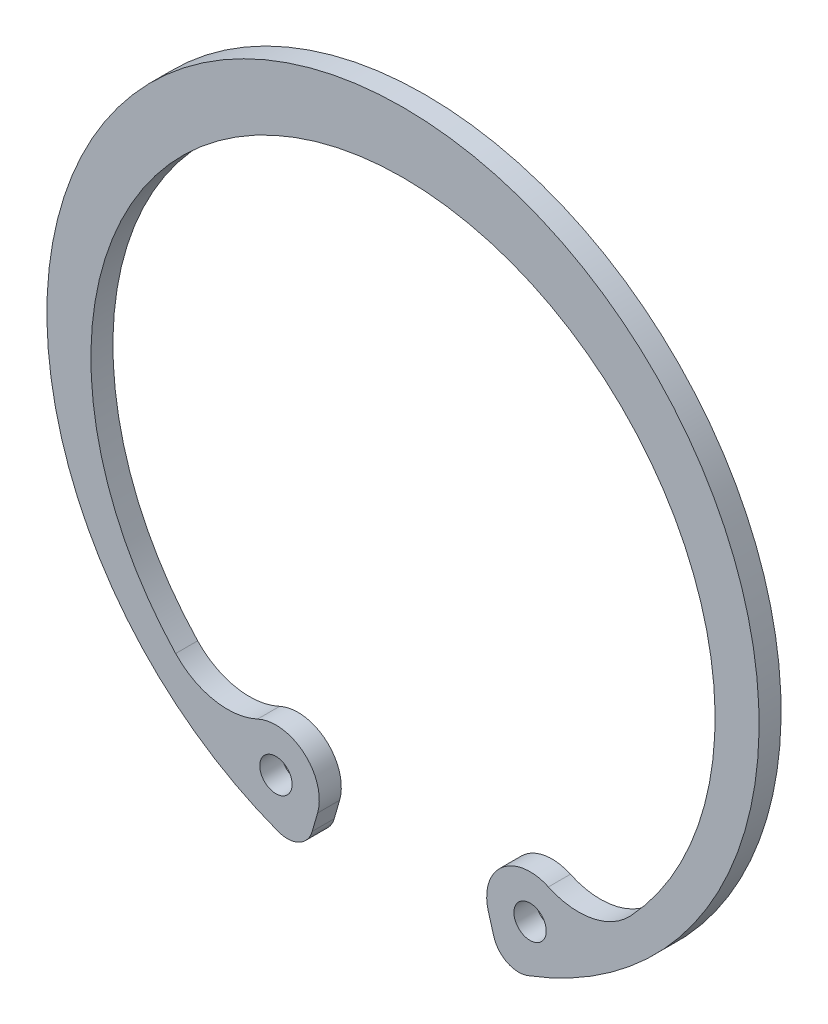
ISO-10303-21;
HEADER;
FILE_DESCRIPTION(('STEP AP214'),'2;1');
FILE_NAME('part.step','',(''),(''),'','','');
FILE_SCHEMA(('AUTOMOTIVE_DESIGN { 1 0 10303 214 1 1 1 1 }'));
ENDSEC;
DATA;
#1=APPLICATION_CONTEXT('core data for automotive mechanical design processes');
#2=APPLICATION_PROTOCOL_DEFINITION('international standard','automotive_design',2000,#1);
#3=PRODUCT_CONTEXT('',#1,'mechanical');
#4=PRODUCT('Part','Part','',(#3));
#5=PRODUCT_RELATED_PRODUCT_CATEGORY('part','',(#4));
#6=PRODUCT_DEFINITION_FORMATION('','',#4);
#7=PRODUCT_DEFINITION_CONTEXT('part definition',#1,'design');
#8=PRODUCT_DEFINITION('design','',#6,#7);
#9=PRODUCT_DEFINITION_SHAPE('','',#8);
#10=(LENGTH_UNIT() NAMED_UNIT(*) SI_UNIT(.MILLI.,.METRE.));
#11=(NAMED_UNIT(*) PLANE_ANGLE_UNIT() SI_UNIT($,.RADIAN.));
#12=(NAMED_UNIT(*) SI_UNIT($,.STERADIAN.) SOLID_ANGLE_UNIT());
#13=UNCERTAINTY_MEASURE_WITH_UNIT(LENGTH_MEASURE(1.E-05),#10,'distance_accuracy_value','');
#14=(GEOMETRIC_REPRESENTATION_CONTEXT(3) GLOBAL_UNCERTAINTY_ASSIGNED_CONTEXT((#13)) GLOBAL_UNIT_ASSIGNED_CONTEXT((#10,
#11,#12)) REPRESENTATION_CONTEXT('',''));
#15=CARTESIAN_POINT('',(0.,0.,0.));
#16=DIRECTION('',(0.,0.,1.));
#17=DIRECTION('',(1.,0.,0.));
#18=AXIS2_PLACEMENT_3D('',#15,#16,#17);
#19=CARTESIAN_POINT('',(-13.5506791910204,-14.045394064784,1.7));
#20=DIRECTION('',(0.,0.,1.));
#21=DIRECTION('',(1.,0.,0.));
#22=AXIS2_PLACEMENT_3D('',#19,#20,#21);
#23=PLANE('',#22);
#24=CARTESIAN_POINT('',(-9.8132507378966,-22.0674965671072,1.7));
#25=DIRECTION('',(0.,0.,1.));
#26=DIRECTION('',(1.,0.,0.));
#27=AXIS2_PLACEMENT_3D('',#24,#25,#26);
#28=CIRCLE('',#27,1.25);
#29=CARTESIAN_POINT('',(-8.5632507378966,-22.0674965671072,1.7));
#30=VERTEX_POINT('',#29);
#31=EDGE_CURVE('E150',#30,#30,#28,.T.);
#32=ORIENTED_EDGE('',*,*,#31,.F.);
#33=EDGE_LOOP('',(#32));
#34=FACE_BOUND('',#33,.T.);
#35=CARTESIAN_POINT('',(-13.5506791910204,-14.045394064784,1.7));
#36=DIRECTION('',(0.,0.,-1.));
#37=DIRECTION('',(1.,0.,0.));
#38=AXIS2_PLACEMENT_3D('',#35,#36,#37);
#39=CIRCLE('',#38,5.49999999999998);
#40=CARTESIAN_POINT('',(-11.2279835421864,-19.0308814956063,1.7));
#41=VERTEX_POINT('',#40);
#42=CARTESIAN_POINT('',(-17.5572363209895,-17.8133510661699,1.7));
#43=VERTEX_POINT('',#42);
#44=EDGE_CURVE('E165',#41,#43,#39,.T.);
#45=ORIENTED_EDGE('',*,*,#44,.T.);
#46=CARTESIAN_POINT('',(0.,-1.30169046215154,1.7));
#47=DIRECTION('',(0.,0.,-1.));
#48=DIRECTION('',(1.,0.,0.));
#49=AXIS2_PLACEMENT_3D('',#46,#47,#48);
#50=CIRCLE('',#49,24.1016904621515);
#51=CARTESIAN_POINT('',(17.5572363209895,-17.8133510661699,1.7));
#52=VERTEX_POINT('',#51);
#53=EDGE_CURVE('E103',#43,#52,#50,.T.);
#54=ORIENTED_EDGE('',*,*,#53,.T.);
#55=CARTESIAN_POINT('',(13.5506791910204,-14.045394064784,1.7));
#56=DIRECTION('',(0.,0.,-1.));
#57=DIRECTION('',(-1.,0.,0.));
#58=AXIS2_PLACEMENT_3D('',#55,#56,#57);
#59=CIRCLE('',#58,5.49999999999998);
#60=CARTESIAN_POINT('',(11.2279835421864,-19.0308814956063,1.7));
#61=VERTEX_POINT('',#60);
#62=EDGE_CURVE('E186',#52,#61,#59,.T.);
#63=ORIENTED_EDGE('',*,*,#62,.T.);
#64=CARTESIAN_POINT('',(9.8132507378966,-22.0674965671072,1.7));
#65=DIRECTION('',(0.,0.,1.));
#66=DIRECTION('',(-1.,0.,0.));
#67=AXIS2_PLACEMENT_3D('',#64,#65,#66);
#68=CIRCLE('',#67,3.35);
#69=CARTESIAN_POINT('',(6.59482328368072,-22.9971334435001,1.7));
#70=VERTEX_POINT('',#69);
#71=EDGE_CURVE('E205',#61,#70,#68,.T.);
#72=ORIENTED_EDGE('',*,*,#71,.T.);
#73=DIRECTION('',(0.277503545191909,-0.960724613198768,0.));
#74=VECTOR('',#73,1.);
#75=CARTESIAN_POINT('',(7.01136277037284,-24.4392041635608,1.7));
#76=LINE('',#75,#74);
#77=CARTESIAN_POINT('',(7.01136277037284,-24.4392041635608,1.7));
#78=VERTEX_POINT('',#77);
#79=EDGE_CURVE('E202',#70,#78,#76,.T.);
#80=ORIENTED_EDGE('',*,*,#79,.T.);
#81=CARTESIAN_POINT('',(8.93281199677038,-23.884197073177,1.7));
#82=DIRECTION('',(0.,0.,1.));
#83=DIRECTION('',(-1.,0.,0.));
#84=AXIS2_PLACEMENT_3D('',#81,#82,#83);
#85=CIRCLE('',#84,2.00000000000001);
#86=CARTESIAN_POINT('',(9.63342470239945,-25.7574674318575,1.7));
#87=VERTEX_POINT('',#86);
#88=EDGE_CURVE('E204',#78,#87,#85,.T.);
#89=ORIENTED_EDGE('',*,*,#88,.T.);
#90=CARTESIAN_POINT('',(0.,0.,1.7));
#91=DIRECTION('',(0.,0.,1.));
#92=DIRECTION('',(1.,0.,0.));
#93=AXIS2_PLACEMENT_3D('',#90,#91,#92);
#94=CIRCLE('',#93,27.5);
#95=CARTESIAN_POINT('',(-9.63342470239945,-25.7574674318575,1.7));
#96=VERTEX_POINT('',#95);
#97=EDGE_CURVE('E128',#87,#96,#94,.T.);
#98=ORIENTED_EDGE('',*,*,#97,.T.);
#99=CARTESIAN_POINT('',(-8.93281199677038,-23.884197073177,1.7));
#100=DIRECTION('',(0.,0.,1.));
#101=DIRECTION('',(1.,0.,0.));
#102=AXIS2_PLACEMENT_3D('',#99,#100,#101);
#103=CIRCLE('',#102,2.00000000000001);
#104=CARTESIAN_POINT('',(-7.01136277037284,-24.4392041635608,1.7));
#105=VERTEX_POINT('',#104);
#106=EDGE_CURVE('E122',#96,#105,#103,.T.);
#107=ORIENTED_EDGE('',*,*,#106,.T.);
#108=DIRECTION('',(0.277503545191909,0.960724613198768,0.));
#109=VECTOR('',#108,1.);
#110=CARTESIAN_POINT('',(-7.01136277037284,-24.4392041635608,1.7));
#111=LINE('',#110,#109);
#112=CARTESIAN_POINT('',(-6.59482328368072,-22.9971334435001,1.7));
#113=VERTEX_POINT('',#112);
#114=EDGE_CURVE('E126',#105,#113,#111,.T.);
#115=ORIENTED_EDGE('',*,*,#114,.T.);
#116=CARTESIAN_POINT('',(-9.8132507378966,-22.0674965671072,1.7));
#117=DIRECTION('',(0.,0.,1.));
#118=DIRECTION('',(1.,0.,0.));
#119=AXIS2_PLACEMENT_3D('',#116,#117,#118);
#120=CIRCLE('',#119,3.35);
#121=EDGE_CURVE('E54',#113,#41,#120,.T.);
#122=ORIENTED_EDGE('',*,*,#121,.T.);
#123=EDGE_LOOP('',(#45,#54,#63,#72,#80,#89,#98,#107,#115,#122));
#124=FACE_BOUND('',#123,.T.);
#125=CARTESIAN_POINT('',(9.8132507378966,-22.0674965671072,1.7));
#126=DIRECTION('',(0.,0.,1.));
#127=DIRECTION('',(-1.,0.,0.));
#128=AXIS2_PLACEMENT_3D('',#125,#126,#127);
#129=CIRCLE('',#128,1.25);
#130=CARTESIAN_POINT('',(8.5632507378966,-22.0674965671072,1.7));
#131=VERTEX_POINT('',#130);
#132=EDGE_CURVE('E216',#131,#131,#129,.T.);
#133=ORIENTED_EDGE('',*,*,#132,.F.);
#134=EDGE_LOOP('',(#133));
#135=FACE_BOUND('',#134,.T.);
#136=ADVANCED_FACE('F37',(#34,#124,#135),#23,.T.);
#137=CARTESIAN_POINT('',(-13.5506791910204,-14.045394064784,0.));
#138=DIRECTION('',(0.,0.,1.));
#139=DIRECTION('',(1.,0.,0.));
#140=AXIS2_PLACEMENT_3D('',#137,#138,#139);
#141=PLANE('',#140);
#142=CARTESIAN_POINT('',(-13.5506791910204,-14.045394064784,0.));
#143=DIRECTION('',(0.,0.,-1.));
#144=DIRECTION('',(1.,0.,0.));
#145=AXIS2_PLACEMENT_3D('',#142,#143,#144);
#146=CIRCLE('',#145,5.49999999999998);
#147=CARTESIAN_POINT('',(-11.2279835421864,-19.0308814956063,0.));
#148=VERTEX_POINT('',#147);
#149=CARTESIAN_POINT('',(-17.5572363209895,-17.8133510661699,0.));
#150=VERTEX_POINT('',#149);
#151=EDGE_CURVE('E146',#148,#150,#146,.T.);
#152=ORIENTED_EDGE('',*,*,#151,.F.);
#153=CARTESIAN_POINT('',(-9.8132507378966,-22.0674965671072,0.));
#154=DIRECTION('',(0.,0.,1.));
#155=DIRECTION('',(1.,0.,0.));
#156=AXIS2_PLACEMENT_3D('',#153,#154,#155);
#157=CIRCLE('',#156,3.35);
#158=CARTESIAN_POINT('',(-6.59482328368072,-22.9971334435001,0.));
#159=VERTEX_POINT('',#158);
#160=EDGE_CURVE('E95',#159,#148,#157,.T.);
#161=ORIENTED_EDGE('',*,*,#160,.F.);
#162=DIRECTION('',(0.277503545191909,0.960724613198768,0.));
#163=VECTOR('',#162,1.);
#164=CARTESIAN_POINT('',(-7.01136277037284,-24.4392041635608,0.));
#165=LINE('',#164,#163);
#166=CARTESIAN_POINT('',(-7.01136277037284,-24.4392041635608,0.));
#167=VERTEX_POINT('',#166);
#168=EDGE_CURVE('E89',#167,#159,#165,.T.);
#169=ORIENTED_EDGE('',*,*,#168,.F.);
#170=CARTESIAN_POINT('',(-8.93281199677038,-23.884197073177,0.));
#171=DIRECTION('',(0.,0.,1.));
#172=DIRECTION('',(1.,0.,0.));
#173=AXIS2_PLACEMENT_3D('',#170,#171,#172);
#174=CIRCLE('',#173,2.00000000000001);
#175=CARTESIAN_POINT('',(-9.63342470239945,-25.7574674318575,0.));
#176=VERTEX_POINT('',#175);
#177=EDGE_CURVE('E136',#176,#167,#174,.T.);
#178=ORIENTED_EDGE('',*,*,#177,.F.);
#179=CARTESIAN_POINT('',(0.,0.,0.));
#180=DIRECTION('',(0.,0.,1.));
#181=DIRECTION('',(1.,0.,0.));
#182=AXIS2_PLACEMENT_3D('',#179,#180,#181);
#183=CIRCLE('',#182,27.5);
#184=CARTESIAN_POINT('',(9.63342470239945,-25.7574674318575,0.));
#185=VERTEX_POINT('',#184);
#186=EDGE_CURVE('E160',#185,#176,#183,.T.);
#187=ORIENTED_EDGE('',*,*,#186,.F.);
#188=CARTESIAN_POINT('',(8.93281199677038,-23.884197073177,0.));
#189=DIRECTION('',(0.,0.,1.));
#190=DIRECTION('',(-1.,0.,0.));
#191=AXIS2_PLACEMENT_3D('',#188,#189,#190);
#192=CIRCLE('',#191,2.00000000000001);
#193=CARTESIAN_POINT('',(7.01136277037284,-24.4392041635608,0.));
#194=VERTEX_POINT('',#193);
#195=EDGE_CURVE('E158',#194,#185,#192,.T.);
#196=ORIENTED_EDGE('',*,*,#195,.F.);
#197=DIRECTION('',(0.277503545191909,-0.960724613198768,0.));
#198=VECTOR('',#197,1.);
#199=CARTESIAN_POINT('',(7.01136277037284,-24.4392041635608,0.));
#200=LINE('',#199,#198);
#201=CARTESIAN_POINT('',(6.59482328368072,-22.9971334435001,0.));
#202=VERTEX_POINT('',#201);
#203=EDGE_CURVE('E156',#202,#194,#200,.T.);
#204=ORIENTED_EDGE('',*,*,#203,.F.);
#205=CARTESIAN_POINT('',(9.8132507378966,-22.0674965671072,0.));
#206=DIRECTION('',(0.,0.,1.));
#207=DIRECTION('',(-1.,0.,0.));
#208=AXIS2_PLACEMENT_3D('',#205,#206,#207);
#209=CIRCLE('',#208,3.35);
#210=CARTESIAN_POINT('',(11.2279835421864,-19.0308814956063,0.));
#211=VERTEX_POINT('',#210);
#212=EDGE_CURVE('E154',#211,#202,#209,.T.);
#213=ORIENTED_EDGE('',*,*,#212,.F.);
#214=CARTESIAN_POINT('',(13.5506791910204,-14.045394064784,0.));
#215=DIRECTION('',(0.,0.,-1.));
#216=DIRECTION('',(-1.,0.,0.));
#217=AXIS2_PLACEMENT_3D('',#214,#215,#216);
#218=CIRCLE('',#217,5.49999999999998);
#219=CARTESIAN_POINT('',(17.5572363209895,-17.8133510661699,0.));
#220=VERTEX_POINT('',#219);
#221=EDGE_CURVE('E152',#220,#211,#218,.T.);
#222=ORIENTED_EDGE('',*,*,#221,.F.);
#223=CARTESIAN_POINT('',(0.,-1.30169046215154,0.));
#224=DIRECTION('',(0.,0.,-1.));
#225=DIRECTION('',(1.,0.,0.));
#226=AXIS2_PLACEMENT_3D('',#223,#224,#225);
#227=CIRCLE('',#226,24.1016904621515);
#228=EDGE_CURVE('E149',#150,#220,#227,.T.);
#229=ORIENTED_EDGE('',*,*,#228,.F.);
#230=EDGE_LOOP('',(#152,#161,#169,#178,#187,#196,#204,#213,#222,#229));
#231=FACE_BOUND('',#230,.T.);
#232=CARTESIAN_POINT('',(-9.8132507378966,-22.0674965671072,0.));
#233=DIRECTION('',(0.,0.,1.));
#234=DIRECTION('',(1.,0.,0.));
#235=AXIS2_PLACEMENT_3D('',#232,#233,#234);
#236=CIRCLE('',#235,1.25);
#237=CARTESIAN_POINT('',(-8.5632507378966,-22.0674965671072,0.));
#238=VERTEX_POINT('',#237);
#239=EDGE_CURVE('E213',#238,#238,#236,.T.);
#240=ORIENTED_EDGE('',*,*,#239,.T.);
#241=EDGE_LOOP('',(#240));
#242=FACE_BOUND('',#241,.T.);
#243=CARTESIAN_POINT('',(9.8132507378966,-22.0674965671072,0.));
#244=DIRECTION('',(0.,0.,1.));
#245=DIRECTION('',(-1.,0.,0.));
#246=AXIS2_PLACEMENT_3D('',#243,#244,#245);
#247=CIRCLE('',#246,1.25);
#248=CARTESIAN_POINT('',(8.5632507378966,-22.0674965671072,0.));
#249=VERTEX_POINT('',#248);
#250=EDGE_CURVE('E219',#249,#249,#247,.T.);
#251=ORIENTED_EDGE('',*,*,#250,.T.);
#252=EDGE_LOOP('',(#251));
#253=FACE_BOUND('',#252,.T.);
#254=ADVANCED_FACE('F190',(#231,#242,#253),#141,.F.);
#255=CARTESIAN_POINT('',(-13.5506791910204,-14.045394064784,1.7));
#256=DIRECTION('',(0.,0.,-1.));
#257=DIRECTION('',(-1.,0.,0.));
#258=AXIS2_PLACEMENT_3D('',#255,#256,#257);
#259=CYLINDRICAL_SURFACE('',#258,5.49999999999998);
#260=ORIENTED_EDGE('',*,*,#151,.T.);
#261=DIRECTION('',(0.,0.,-1.));
#262=VECTOR('',#261,1.);
#263=CARTESIAN_POINT('',(-17.5572363209895,-17.8133510661699,1.7));
#264=LINE('',#263,#262);
#265=EDGE_CURVE('E11',#43,#150,#264,.T.);
#266=ORIENTED_EDGE('',*,*,#265,.F.);
#267=ORIENTED_EDGE('',*,*,#44,.F.);
#268=DIRECTION('',(0.,0.,-1.));
#269=VECTOR('',#268,1.);
#270=CARTESIAN_POINT('',(-11.2279835421864,-19.0308814956063,1.7));
#271=LINE('',#270,#269);
#272=EDGE_CURVE('E142',#41,#148,#271,.T.);
#273=ORIENTED_EDGE('',*,*,#272,.T.);
#274=EDGE_LOOP('',(#260,#266,#267,#273));
#275=FACE_BOUND('',#274,.T.);
#276=ADVANCED_FACE('F39',(#275),#259,.F.);
#277=CARTESIAN_POINT('',(0.,-1.30169046215154,1.7));
#278=DIRECTION('',(0.,0.,-1.));
#279=DIRECTION('',(-1.,0.,0.));
#280=AXIS2_PLACEMENT_3D('',#277,#278,#279);
#281=CYLINDRICAL_SURFACE('',#280,24.1016904621515);
#282=ORIENTED_EDGE('',*,*,#228,.T.);
#283=DIRECTION('',(0.,0.,-1.));
#284=VECTOR('',#283,1.);
#285=CARTESIAN_POINT('',(17.5572363209895,-17.8133510661699,1.7));
#286=LINE('',#285,#284);
#287=EDGE_CURVE('E46',#52,#220,#286,.T.);
#288=ORIENTED_EDGE('',*,*,#287,.F.);
#289=ORIENTED_EDGE('',*,*,#53,.F.);
#290=ORIENTED_EDGE('',*,*,#265,.T.);
#291=EDGE_LOOP('',(#282,#288,#289,#290));
#292=FACE_BOUND('',#291,.T.);
#293=ADVANCED_FACE('F259',(#292),#281,.F.);
#294=CARTESIAN_POINT('',(13.5506791910204,-14.045394064784,1.7));
#295=DIRECTION('',(0.,0.,-1.));
#296=DIRECTION('',(-1.,0.,0.));
#297=AXIS2_PLACEMENT_3D('',#294,#295,#296);
#298=CYLINDRICAL_SURFACE('',#297,5.49999999999998);
#299=ORIENTED_EDGE('',*,*,#221,.T.);
#300=DIRECTION('',(0.,0.,-1.));
#301=VECTOR('',#300,1.);
#302=CARTESIAN_POINT('',(11.2279835421864,-19.0308814956063,1.7));
#303=LINE('',#302,#301);
#304=EDGE_CURVE('E178',#61,#211,#303,.T.);
#305=ORIENTED_EDGE('',*,*,#304,.F.);
#306=ORIENTED_EDGE('',*,*,#62,.F.);
#307=ORIENTED_EDGE('',*,*,#287,.T.);
#308=EDGE_LOOP('',(#299,#305,#306,#307));
#309=FACE_BOUND('',#308,.T.);
#310=ADVANCED_FACE('F184',(#309),#298,.F.);
#311=CARTESIAN_POINT('',(9.8132507378966,-22.0674965671072,1.7));
#312=DIRECTION('',(0.,0.,-1.));
#313=DIRECTION('',(-1.,0.,0.));
#314=AXIS2_PLACEMENT_3D('',#311,#312,#313);
#315=CYLINDRICAL_SURFACE('',#314,3.35);
#316=ORIENTED_EDGE('',*,*,#212,.T.);
#317=DIRECTION('',(0.,0.,-1.));
#318=VECTOR('',#317,1.);
#319=CARTESIAN_POINT('',(6.59482328368072,-22.9971334435001,1.7));
#320=LINE('',#319,#318);
#321=EDGE_CURVE('E175',#70,#202,#320,.T.);
#322=ORIENTED_EDGE('',*,*,#321,.F.);
#323=ORIENTED_EDGE('',*,*,#71,.F.);
#324=ORIENTED_EDGE('',*,*,#304,.T.);
#325=EDGE_LOOP('',(#316,#322,#323,#324));
#326=FACE_BOUND('',#325,.T.);
#327=ADVANCED_FACE('F196',(#326),#315,.T.);
#328=CARTESIAN_POINT('',(7.01136277037284,-24.4392041635608,1.7));
#329=DIRECTION('',(0.960724613198768,0.277503545191909,0.));
#330=DIRECTION('',(-0.277503545191909,0.960724613198768,0.));
#331=AXIS2_PLACEMENT_3D('',#328,#329,#330);
#332=PLANE('',#331);
#333=ORIENTED_EDGE('',*,*,#203,.T.);
#334=DIRECTION('',(0.,0.,-1.));
#335=VECTOR('',#334,1.);
#336=CARTESIAN_POINT('',(7.01136277037284,-24.4392041635608,1.7));
#337=LINE('',#336,#335);
#338=EDGE_CURVE('E172',#78,#194,#337,.T.);
#339=ORIENTED_EDGE('',*,*,#338,.F.);
#340=ORIENTED_EDGE('',*,*,#79,.F.);
#341=ORIENTED_EDGE('',*,*,#321,.T.);
#342=EDGE_LOOP('',(#333,#339,#340,#341));
#343=FACE_BOUND('',#342,.T.);
#344=ADVANCED_FACE('F200',(#343),#332,.F.);
#345=CARTESIAN_POINT('',(8.93281199677038,-23.884197073177,1.7));
#346=DIRECTION('',(0.,0.,-1.));
#347=DIRECTION('',(-1.,0.,0.));
#348=AXIS2_PLACEMENT_3D('',#345,#346,#347);
#349=CYLINDRICAL_SURFACE('',#348,2.00000000000001);
#350=ORIENTED_EDGE('',*,*,#195,.T.);
#351=DIRECTION('',(0.,0.,-1.));
#352=VECTOR('',#351,1.);
#353=CARTESIAN_POINT('',(9.63342470239945,-25.7574674318575,1.7));
#354=LINE('',#353,#352);
#355=EDGE_CURVE('E169',#87,#185,#354,.T.);
#356=ORIENTED_EDGE('',*,*,#355,.F.);
#357=ORIENTED_EDGE('',*,*,#88,.F.);
#358=ORIENTED_EDGE('',*,*,#338,.T.);
#359=EDGE_LOOP('',(#350,#356,#357,#358));
#360=FACE_BOUND('',#359,.T.);
#361=ADVANCED_FACE('F249',(#360),#349,.T.);
#362=CARTESIAN_POINT('',(0.,0.,1.7));
#363=DIRECTION('',(0.,0.,-1.));
#364=DIRECTION('',(-1.,0.,0.));
#365=AXIS2_PLACEMENT_3D('',#362,#363,#364);
#366=CYLINDRICAL_SURFACE('',#365,27.5);
#367=ORIENTED_EDGE('',*,*,#186,.T.);
#368=DIRECTION('',(0.,0.,-1.));
#369=VECTOR('',#368,1.);
#370=CARTESIAN_POINT('',(-9.63342470239945,-25.7574674318575,1.7));
#371=LINE('',#370,#369);
#372=EDGE_CURVE('E137',#96,#176,#371,.T.);
#373=ORIENTED_EDGE('',*,*,#372,.F.);
#374=ORIENTED_EDGE('',*,*,#97,.F.);
#375=ORIENTED_EDGE('',*,*,#355,.T.);
#376=EDGE_LOOP('',(#367,#373,#374,#375));
#377=FACE_BOUND('',#376,.T.);
#378=ADVANCED_FACE('F246',(#377),#366,.T.);
#379=CARTESIAN_POINT('',(-8.93281199677038,-23.884197073177,1.7));
#380=DIRECTION('',(0.,0.,-1.));
#381=DIRECTION('',(-1.,0.,0.));
#382=AXIS2_PLACEMENT_3D('',#379,#380,#381);
#383=CYLINDRICAL_SURFACE('',#382,2.00000000000001);
#384=ORIENTED_EDGE('',*,*,#177,.T.);
#385=DIRECTION('',(0.,0.,-1.));
#386=VECTOR('',#385,1.);
#387=CARTESIAN_POINT('',(-7.01136277037284,-24.4392041635608,1.7));
#388=LINE('',#387,#386);
#389=EDGE_CURVE('E133',#105,#167,#388,.T.);
#390=ORIENTED_EDGE('',*,*,#389,.F.);
#391=ORIENTED_EDGE('',*,*,#106,.F.);
#392=ORIENTED_EDGE('',*,*,#372,.T.);
#393=EDGE_LOOP('',(#384,#390,#391,#392));
#394=FACE_BOUND('',#393,.T.);
#395=ADVANCED_FACE('F134',(#394),#383,.T.);
#396=CARTESIAN_POINT('',(-7.01136277037284,-24.4392041635608,1.7));
#397=DIRECTION('',(-0.960724613198768,0.277503545191909,0.));
#398=DIRECTION('',(-0.277503545191909,-0.960724613198768,0.));
#399=AXIS2_PLACEMENT_3D('',#396,#397,#398);
#400=PLANE('',#399);
#401=ORIENTED_EDGE('',*,*,#168,.T.);
#402=DIRECTION('',(0.,0.,-1.));
#403=VECTOR('',#402,1.);
#404=CARTESIAN_POINT('',(-6.59482328368072,-22.9971334435001,1.7));
#405=LINE('',#404,#403);
#406=EDGE_CURVE('E138',#113,#159,#405,.T.);
#407=ORIENTED_EDGE('',*,*,#406,.F.);
#408=ORIENTED_EDGE('',*,*,#114,.F.);
#409=ORIENTED_EDGE('',*,*,#389,.T.);
#410=EDGE_LOOP('',(#401,#407,#408,#409));
#411=FACE_BOUND('',#410,.T.);
#412=ADVANCED_FACE('F140',(#411),#400,.F.);
#413=CARTESIAN_POINT('',(-9.8132507378966,-22.0674965671072,1.7));
#414=DIRECTION('',(0.,0.,-1.));
#415=DIRECTION('',(-1.,0.,0.));
#416=AXIS2_PLACEMENT_3D('',#413,#414,#415);
#417=CYLINDRICAL_SURFACE('',#416,3.35);
#418=ORIENTED_EDGE('',*,*,#160,.T.);
#419=ORIENTED_EDGE('',*,*,#272,.F.);
#420=ORIENTED_EDGE('',*,*,#121,.F.);
#421=ORIENTED_EDGE('',*,*,#406,.T.);
#422=EDGE_LOOP('',(#418,#419,#420,#421));
#423=FACE_BOUND('',#422,.T.);
#424=ADVANCED_FACE('F239',(#423),#417,.T.);
#425=CARTESIAN_POINT('',(-9.8132507378966,-22.0674965671072,1.7));
#426=DIRECTION('',(0.,0.,-1.));
#427=DIRECTION('',(-1.,0.,0.));
#428=AXIS2_PLACEMENT_3D('',#425,#426,#427);
#429=CYLINDRICAL_SURFACE('',#428,1.25);
#430=ORIENTED_EDGE('',*,*,#31,.T.);
#431=EDGE_LOOP('',(#430));
#432=FACE_BOUND('',#431,.T.);
#433=ORIENTED_EDGE('',*,*,#239,.F.);
#434=EDGE_LOOP('',(#433));
#435=FACE_BOUND('',#434,.T.);
#436=ADVANCED_FACE('F236',(#432,#435),#429,.F.);
#437=CARTESIAN_POINT('',(9.8132507378966,-22.0674965671072,1.7));
#438=DIRECTION('',(0.,0.,-1.));
#439=DIRECTION('',(-1.,0.,0.));
#440=AXIS2_PLACEMENT_3D('',#437,#438,#439);
#441=CYLINDRICAL_SURFACE('',#440,1.25);
#442=ORIENTED_EDGE('',*,*,#132,.T.);
#443=EDGE_LOOP('',(#442));
#444=FACE_BOUND('',#443,.T.);
#445=ORIENTED_EDGE('',*,*,#250,.F.);
#446=EDGE_LOOP('',(#445));
#447=FACE_BOUND('',#446,.T.);
#448=ADVANCED_FACE('F225',(#444,#447),#441,.F.);
#449=CLOSED_SHELL('',(#136,#254,#276,#293,#310,#327,#344,#361,#378,#395,#412,#424,#436,#448));
#450=MANIFOLD_SOLID_BREP('B2',#449);
#451=ADVANCED_BREP_SHAPE_REPRESENTATION('',(#18,#450),#14);
#452=SHAPE_DEFINITION_REPRESENTATION(#9,#451);
ENDSEC;
END-ISO-10303-21;
